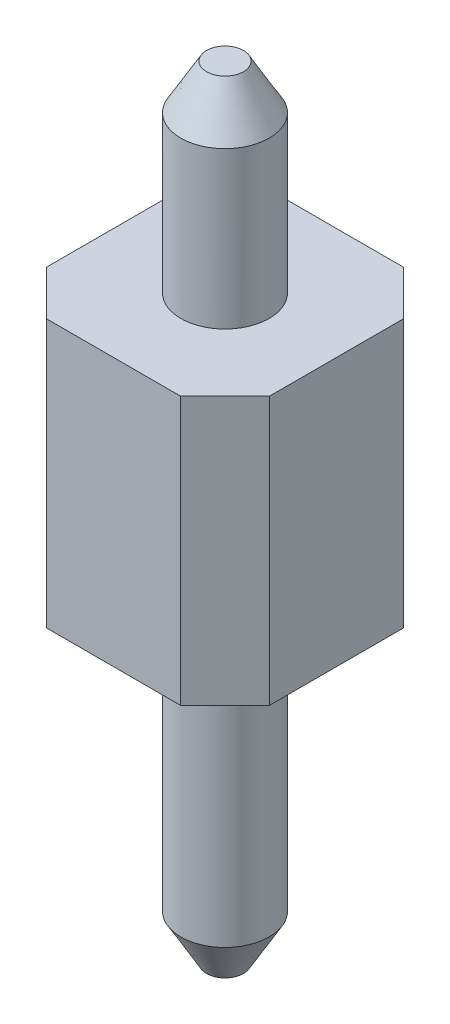
ISO-10303-21;
HEADER;
FILE_DESCRIPTION(('STEP AP214'),'2;1');
FILE_NAME('part.step','',(''),(''),'','','');
FILE_SCHEMA(('AUTOMOTIVE_DESIGN { 1 0 10303 214 1 1 1 1 }'));
ENDSEC;
DATA;
#1=APPLICATION_CONTEXT('core data for automotive mechanical design processes');
#2=APPLICATION_PROTOCOL_DEFINITION('international standard','automotive_design',2000,#1);
#3=PRODUCT_CONTEXT('',#1,'mechanical');
#4=PRODUCT('Part','Part','',(#3));
#5=PRODUCT_RELATED_PRODUCT_CATEGORY('part','',(#4));
#6=PRODUCT_DEFINITION_FORMATION('','',#4);
#7=PRODUCT_DEFINITION_CONTEXT('part definition',#1,'design');
#8=PRODUCT_DEFINITION('design','',#6,#7);
#9=PRODUCT_DEFINITION_SHAPE('','',#8);
#10=(LENGTH_UNIT() NAMED_UNIT(*) SI_UNIT(.MILLI.,.METRE.));
#11=(NAMED_UNIT(*) PLANE_ANGLE_UNIT() SI_UNIT($,.RADIAN.));
#12=(NAMED_UNIT(*) SI_UNIT($,.STERADIAN.) SOLID_ANGLE_UNIT());
#13=UNCERTAINTY_MEASURE_WITH_UNIT(LENGTH_MEASURE(1.E-05),#10,'distance_accuracy_value','');
#14=(GEOMETRIC_REPRESENTATION_CONTEXT(3) GLOBAL_UNCERTAINTY_ASSIGNED_CONTEXT((#13)) GLOBAL_UNIT_ASSIGNED_CONTEXT((#10,
#11,#12)) REPRESENTATION_CONTEXT('',''));
#15=CARTESIAN_POINT('',(0.,0.,0.));
#16=DIRECTION('',(0.,0.,1.));
#17=DIRECTION('',(1.,0.,0.));
#18=AXIS2_PLACEMENT_3D('',#15,#16,#17);
#19=CARTESIAN_POINT('',(1.25000000000001,-1.5,1.25));
#20=DIRECTION('',(0.,-1.,0.));
#21=DIRECTION('',(0.,0.,-1.));
#22=AXIS2_PLACEMENT_3D('',#19,#20,#21);
#23=PLANE('',#22);
#24=DIRECTION('',(0.,0.,1.));
#25=VECTOR('',#24,1.);
#26=CARTESIAN_POINT('',(-1.25,-1.5,-1.25));
#27=LINE('',#26,#25);
#28=CARTESIAN_POINT('',(-1.25,-1.5,-0.750000000000002));
#29=VERTEX_POINT('',#28);
#30=CARTESIAN_POINT('',(-1.25,-1.5,0.75));
#31=VERTEX_POINT('',#30);
#32=EDGE_CURVE('E121',#29,#31,#27,.T.);
#33=ORIENTED_EDGE('',*,*,#32,.F.);
#34=DIRECTION('',(-0.707106781186549,0.,0.707106781186546));
#35=VECTOR('',#34,1.);
#36=CARTESIAN_POINT('',(-0.999999999999994,-1.5,-1.00000000000001));
#37=LINE('',#36,#35);
#38=CARTESIAN_POINT('',(-0.75,-1.5,-1.25));
#39=VERTEX_POINT('',#38);
#40=EDGE_CURVE('E104',#29,#39,#37,.F.);
#41=ORIENTED_EDGE('',*,*,#40,.T.);
#42=DIRECTION('',(-1.,0.,0.));
#43=VECTOR('',#42,1.);
#44=CARTESIAN_POINT('',(-1.25,-1.5,-1.25));
#45=LINE('',#44,#43);
#46=CARTESIAN_POINT('',(0.75,-1.5,-1.25));
#47=VERTEX_POINT('',#46);
#48=EDGE_CURVE('E131',#47,#39,#45,.T.);
#49=ORIENTED_EDGE('',*,*,#48,.F.);
#50=DIRECTION('',(-0.707106781186548,0.,-0.707106781186547));
#51=VECTOR('',#50,1.);
#52=CARTESIAN_POINT('',(2.25000000000001,-1.5,0.250000000000002));
#53=LINE('',#52,#51);
#54=CARTESIAN_POINT('',(1.25,-1.5,-0.75));
#55=VERTEX_POINT('',#54);
#56=EDGE_CURVE('E115',#47,#55,#53,.F.);
#57=ORIENTED_EDGE('',*,*,#56,.T.);
#58=DIRECTION('',(0.,0.,-1.));
#59=VECTOR('',#58,1.);
#60=CARTESIAN_POINT('',(1.25,-1.5,-1.25));
#61=LINE('',#60,#59);
#62=CARTESIAN_POINT('',(1.25000000000001,-1.5,0.750000000000003));
#63=VERTEX_POINT('',#62);
#64=EDGE_CURVE('E135',#63,#55,#61,.T.);
#65=ORIENTED_EDGE('',*,*,#64,.F.);
#66=DIRECTION('',(0.707106781186549,0.,-0.707106781186546));
#67=VECTOR('',#66,1.);
#68=CARTESIAN_POINT('',(1.00000000000001,-1.5,1.));
#69=LINE('',#68,#67);
#70=CARTESIAN_POINT('',(0.750000000000007,-1.5,1.25));
#71=VERTEX_POINT('',#70);
#72=EDGE_CURVE('E150',#63,#71,#69,.F.);
#73=ORIENTED_EDGE('',*,*,#72,.T.);
#74=DIRECTION('',(1.,0.,0.));
#75=VECTOR('',#74,1.);
#76=CARTESIAN_POINT('',(-1.25,-1.5,1.25));
#77=LINE('',#76,#75);
#78=CARTESIAN_POINT('',(-0.750000000000002,-1.5,1.25));
#79=VERTEX_POINT('',#78);
#80=EDGE_CURVE('E236',#79,#71,#77,.T.);
#81=ORIENTED_EDGE('',*,*,#80,.F.);
#82=DIRECTION('',(0.707106781186546,0.,0.707106781186549));
#83=VECTOR('',#82,1.);
#84=CARTESIAN_POINT('',(0.25,-1.5,2.25000000000001));
#85=LINE('',#84,#83);
#86=EDGE_CURVE('E125',#79,#31,#85,.F.);
#87=ORIENTED_EDGE('',*,*,#86,.T.);
#88=EDGE_LOOP('',(#33,#41,#49,#57,#65,#73,#81,#87));
#89=FACE_BOUND('',#88,.T.);
#90=CARTESIAN_POINT('',(0.,-1.5,0.));
#91=DIRECTION('',(0.,-1.,0.));
#92=DIRECTION('',(0.,0.,-1.));
#93=AXIS2_PLACEMENT_3D('',#90,#91,#92);
#94=CIRCLE('',#93,0.4953);
#95=CARTESIAN_POINT('',(0.,-1.5,-0.4953));
#96=VERTEX_POINT('',#95);
#97=EDGE_CURVE('E239',#96,#96,#94,.T.);
#98=ORIENTED_EDGE('',*,*,#97,.F.);
#99=EDGE_LOOP('',(#98));
#100=FACE_BOUND('',#99,.T.);
#101=ADVANCED_FACE('F37',(#89,#100),#23,.T.);
#102=CARTESIAN_POINT('',(1.25000000000001,1.5,1.25));
#103=DIRECTION('',(0.,-1.,0.));
#104=DIRECTION('',(0.,0.,-1.));
#105=AXIS2_PLACEMENT_3D('',#102,#103,#104);
#106=PLANE('',#105);
#107=DIRECTION('',(-1.,0.,0.));
#108=VECTOR('',#107,1.);
#109=CARTESIAN_POINT('',(-1.25,1.5,-1.25));
#110=LINE('',#109,#108);
#111=CARTESIAN_POINT('',(0.75,1.5,-1.25));
#112=VERTEX_POINT('',#111);
#113=CARTESIAN_POINT('',(-0.75,1.5,-1.25));
#114=VERTEX_POINT('',#113);
#115=EDGE_CURVE('E243',#112,#114,#110,.T.);
#116=ORIENTED_EDGE('',*,*,#115,.T.);
#117=DIRECTION('',(0.707106781186549,0.,-0.707106781186546));
#118=VECTOR('',#117,1.);
#119=CARTESIAN_POINT('',(-1.25,1.5,-0.750000000000002));
#120=LINE('',#119,#118);
#121=CARTESIAN_POINT('',(-1.25,1.5,-0.750000000000002));
#122=VERTEX_POINT('',#121);
#123=EDGE_CURVE('E161',#114,#122,#120,.F.);
#124=ORIENTED_EDGE('',*,*,#123,.T.);
#125=DIRECTION('',(0.,0.,1.));
#126=VECTOR('',#125,1.);
#127=CARTESIAN_POINT('',(-1.25,1.5,-1.25));
#128=LINE('',#127,#126);
#129=CARTESIAN_POINT('',(-1.25,1.5,0.749999999999999));
#130=VERTEX_POINT('',#129);
#131=EDGE_CURVE('E124',#122,#130,#128,.T.);
#132=ORIENTED_EDGE('',*,*,#131,.T.);
#133=DIRECTION('',(-0.707106781186546,0.,-0.707106781186549));
#134=VECTOR('',#133,1.);
#135=CARTESIAN_POINT('',(-0.750000000000002,1.5,1.25));
#136=LINE('',#135,#134);
#137=CARTESIAN_POINT('',(-0.750000000000002,1.5,1.25));
#138=VERTEX_POINT('',#137);
#139=EDGE_CURVE('E156',#130,#138,#136,.F.);
#140=ORIENTED_EDGE('',*,*,#139,.T.);
#141=DIRECTION('',(1.,0.,0.));
#142=VECTOR('',#141,1.);
#143=CARTESIAN_POINT('',(-1.25,1.5,1.25));
#144=LINE('',#143,#142);
#145=CARTESIAN_POINT('',(0.750000000000007,1.5,1.25));
#146=VERTEX_POINT('',#145);
#147=EDGE_CURVE('E130',#138,#146,#144,.T.);
#148=ORIENTED_EDGE('',*,*,#147,.T.);
#149=DIRECTION('',(-0.707106781186549,0.,0.707106781186546));
#150=VECTOR('',#149,1.);
#151=CARTESIAN_POINT('',(1.25000000000001,1.5,0.750000000000003));
#152=LINE('',#151,#150);
#153=CARTESIAN_POINT('',(1.25000000000001,1.5,0.750000000000003));
#154=VERTEX_POINT('',#153);
#155=EDGE_CURVE('E59',#146,#154,#152,.F.);
#156=ORIENTED_EDGE('',*,*,#155,.T.);
#157=DIRECTION('',(0.,0.,-1.));
#158=VECTOR('',#157,1.);
#159=CARTESIAN_POINT('',(1.25,1.5,-1.25));
#160=LINE('',#159,#158);
#161=CARTESIAN_POINT('',(1.25,1.5,-0.75));
#162=VERTEX_POINT('',#161);
#163=EDGE_CURVE('E133',#154,#162,#160,.T.);
#164=ORIENTED_EDGE('',*,*,#163,.T.);
#165=DIRECTION('',(0.707106781186548,0.,0.707106781186547));
#166=VECTOR('',#165,1.);
#167=CARTESIAN_POINT('',(0.75,1.5,-1.25));
#168=LINE('',#167,#166);
#169=EDGE_CURVE('E159',#162,#112,#168,.F.);
#170=ORIENTED_EDGE('',*,*,#169,.T.);
#171=EDGE_LOOP('',(#116,#124,#132,#140,#148,#156,#164,#170));
#172=FACE_BOUND('',#171,.T.);
#173=CARTESIAN_POINT('',(0.,1.5,0.));
#174=DIRECTION('',(0.,-1.,0.));
#175=DIRECTION('',(0.,0.,-1.));
#176=AXIS2_PLACEMENT_3D('',#173,#174,#175);
#177=CIRCLE('',#176,0.4953);
#178=CARTESIAN_POINT('',(0.,1.5,-0.4953));
#179=VERTEX_POINT('',#178);
#180=EDGE_CURVE('E139',#179,#179,#177,.F.);
#181=ORIENTED_EDGE('',*,*,#180,.F.);
#182=EDGE_LOOP('',(#181));
#183=FACE_BOUND('',#182,.T.);
#184=ADVANCED_FACE('F185',(#172,#183),#106,.F.);
#185=CARTESIAN_POINT('',(-1.25,1.5,1.25));
#186=DIRECTION('',(0.,0.,-1.));
#187=DIRECTION('',(-1.,0.,0.));
#188=AXIS2_PLACEMENT_3D('',#185,#186,#187);
#189=PLANE('',#188);
#190=ORIENTED_EDGE('',*,*,#80,.T.);
#191=DIRECTION('',(0.,1.,0.));
#192=VECTOR('',#191,1.);
#193=CARTESIAN_POINT('',(0.750000000000007,1.5,1.25));
#194=LINE('',#193,#192);
#195=EDGE_CURVE('E170',#71,#146,#194,.T.);
#196=ORIENTED_EDGE('',*,*,#195,.T.);
#197=ORIENTED_EDGE('',*,*,#147,.F.);
#198=DIRECTION('',(0.,-1.,0.));
#199=VECTOR('',#198,1.);
#200=CARTESIAN_POINT('',(-0.750000000000002,1.5,1.25));
#201=LINE('',#200,#199);
#202=EDGE_CURVE('E167',#138,#79,#201,.T.);
#203=ORIENTED_EDGE('',*,*,#202,.T.);
#204=EDGE_LOOP('',(#190,#196,#197,#203));
#205=FACE_BOUND('',#204,.T.);
#206=ADVANCED_FACE('F190',(#205),#189,.F.);
#207=CARTESIAN_POINT('',(1.25,1.5,-1.25));
#208=DIRECTION('',(-1.,0.,0.));
#209=DIRECTION('',(0.,0.,1.));
#210=AXIS2_PLACEMENT_3D('',#207,#208,#209);
#211=PLANE('',#210);
#212=ORIENTED_EDGE('',*,*,#64,.T.);
#213=DIRECTION('',(0.,1.,0.));
#214=VECTOR('',#213,1.);
#215=CARTESIAN_POINT('',(1.25,1.5,-0.75));
#216=LINE('',#215,#214);
#217=EDGE_CURVE('E52',#55,#162,#216,.T.);
#218=ORIENTED_EDGE('',*,*,#217,.T.);
#219=ORIENTED_EDGE('',*,*,#163,.F.);
#220=DIRECTION('',(0.,-1.,0.));
#221=VECTOR('',#220,1.);
#222=CARTESIAN_POINT('',(1.25000000000001,1.5,0.750000000000003));
#223=LINE('',#222,#221);
#224=EDGE_CURVE('E163',#154,#63,#223,.T.);
#225=ORIENTED_EDGE('',*,*,#224,.T.);
#226=EDGE_LOOP('',(#212,#218,#219,#225));
#227=FACE_BOUND('',#226,.T.);
#228=ADVANCED_FACE('F200',(#227),#211,.F.);
#229=CARTESIAN_POINT('',(-1.25,1.5,-1.25));
#230=DIRECTION('',(0.,0.,1.));
#231=DIRECTION('',(1.,0.,0.));
#232=AXIS2_PLACEMENT_3D('',#229,#230,#231);
#233=PLANE('',#232);
#234=ORIENTED_EDGE('',*,*,#48,.T.);
#235=DIRECTION('',(0.,1.,0.));
#236=VECTOR('',#235,1.);
#237=CARTESIAN_POINT('',(-0.75,1.5,-1.25));
#238=LINE('',#237,#236);
#239=EDGE_CURVE('E109',#39,#114,#238,.T.);
#240=ORIENTED_EDGE('',*,*,#239,.T.);
#241=ORIENTED_EDGE('',*,*,#115,.F.);
#242=DIRECTION('',(0.,-1.,0.));
#243=VECTOR('',#242,1.);
#244=CARTESIAN_POINT('',(0.75,1.5,-1.25));
#245=LINE('',#244,#243);
#246=EDGE_CURVE('E114',#112,#47,#245,.T.);
#247=ORIENTED_EDGE('',*,*,#246,.T.);
#248=EDGE_LOOP('',(#234,#240,#241,#247));
#249=FACE_BOUND('',#248,.T.);
#250=ADVANCED_FACE('F197',(#249),#233,.F.);
#251=CARTESIAN_POINT('',(-1.25,1.5,-1.25));
#252=DIRECTION('',(1.,0.,0.));
#253=DIRECTION('',(0.,0.,-1.));
#254=AXIS2_PLACEMENT_3D('',#251,#252,#253);
#255=PLANE('',#254);
#256=ORIENTED_EDGE('',*,*,#131,.F.);
#257=DIRECTION('',(0.,-1.,0.));
#258=VECTOR('',#257,1.);
#259=CARTESIAN_POINT('',(-1.25,1.5,-0.750000000000002));
#260=LINE('',#259,#258);
#261=EDGE_CURVE('E108',#122,#29,#260,.T.);
#262=ORIENTED_EDGE('',*,*,#261,.T.);
#263=ORIENTED_EDGE('',*,*,#32,.T.);
#264=DIRECTION('',(0.,1.,0.));
#265=VECTOR('',#264,1.);
#266=CARTESIAN_POINT('',(-1.25,1.5,0.75));
#267=LINE('',#266,#265);
#268=EDGE_CURVE('E126',#31,#130,#267,.T.);
#269=ORIENTED_EDGE('',*,*,#268,.T.);
#270=EDGE_LOOP('',(#256,#262,#263,#269));
#271=FACE_BOUND('',#270,.T.);
#272=ADVANCED_FACE('F120',(#271),#255,.F.);
#273=CARTESIAN_POINT('',(0.,3.75,0.));
#274=DIRECTION('',(0.,-1.,0.));
#275=DIRECTION('',(0.,0.,-1.));
#276=AXIS2_PLACEMENT_3D('',#273,#274,#275);
#277=CYLINDRICAL_SURFACE('',#276,0.4953);
#278=CARTESIAN_POINT('',(0.,3.25,0.));
#279=DIRECTION('',(0.,1.,0.));
#280=DIRECTION('',(0.,0.,1.));
#281=AXIS2_PLACEMENT_3D('',#278,#279,#280);
#282=CIRCLE('',#281,0.4953);
#283=CARTESIAN_POINT('',(0.,3.25,0.4953));
#284=VERTEX_POINT('',#283);
#285=EDGE_CURVE('E145',#284,#284,#282,.F.);
#286=ORIENTED_EDGE('',*,*,#285,.T.);
#287=EDGE_LOOP('',(#286));
#288=FACE_BOUND('',#287,.T.);
#289=ORIENTED_EDGE('',*,*,#180,.T.);
#290=EDGE_LOOP('',(#289));
#291=FACE_BOUND('',#290,.T.);
#292=ADVANCED_FACE('F196',(#288,#291),#277,.T.);
#293=CARTESIAN_POINT('',(-2.89142135623731,3.75,0.));
#294=DIRECTION('',(0.,1.,0.));
#295=DIRECTION('',(0.,0.,1.));
#296=AXIS2_PLACEMENT_3D('',#293,#294,#295);
#297=PLANE('',#296);
#298=CARTESIAN_POINT('',(0.,3.75,0.));
#299=DIRECTION('',(0.,1.,0.));
#300=DIRECTION('',(0.,0.,1.));
#301=AXIS2_PLACEMENT_3D('',#298,#299,#300);
#302=CIRCLE('',#301,0.206624865405188);
#303=CARTESIAN_POINT('',(0.,3.75,0.206624865405188));
#304=VERTEX_POINT('',#303);
#305=EDGE_CURVE('E142',#304,#304,#302,.T.);
#306=ORIENTED_EDGE('',*,*,#305,.T.);
#307=EDGE_LOOP('',(#306));
#308=FACE_BOUND('',#307,.T.);
#309=ADVANCED_FACE('F210',(#308),#297,.T.);
#310=CARTESIAN_POINT('',(0.,3.75,0.));
#311=DIRECTION('',(0.,-1.,0.));
#312=DIRECTION('',(0.,0.,-1.));
#313=AXIS2_PLACEMENT_3D('',#310,#311,#312);
#314=CONICAL_SURFACE('',#313,0.206624865405188,0.523598775598297);
#315=ORIENTED_EDGE('',*,*,#285,.F.);
#316=EDGE_LOOP('',(#315));
#317=FACE_BOUND('',#316,.T.);
#318=ORIENTED_EDGE('',*,*,#305,.F.);
#319=EDGE_LOOP('',(#318));
#320=FACE_BOUND('',#319,.T.);
#321=ADVANCED_FACE('F207',(#317,#320),#314,.T.);
#322=CARTESIAN_POINT('',(-1.25,1.5,-0.750000000000002));
#323=DIRECTION('',(0.707106781186546,0.,0.707106781186549));
#324=DIRECTION('',(0.707106781186549,0.,-0.707106781186546));
#325=AXIS2_PLACEMENT_3D('',#322,#323,#324);
#326=PLANE('',#325);
#327=ORIENTED_EDGE('',*,*,#123,.F.);
#328=ORIENTED_EDGE('',*,*,#239,.F.);
#329=ORIENTED_EDGE('',*,*,#40,.F.);
#330=ORIENTED_EDGE('',*,*,#261,.F.);
#331=EDGE_LOOP('',(#327,#328,#329,#330));
#332=FACE_BOUND('',#331,.T.);
#333=ADVANCED_FACE('F107',(#332),#326,.F.);
#334=CARTESIAN_POINT('',(0.75,1.5,-1.25));
#335=DIRECTION('',(-0.707106781186547,0.,0.707106781186548));
#336=DIRECTION('',(0.707106781186548,0.,0.707106781186547));
#337=AXIS2_PLACEMENT_3D('',#334,#335,#336);
#338=PLANE('',#337);
#339=ORIENTED_EDGE('',*,*,#169,.F.);
#340=ORIENTED_EDGE('',*,*,#217,.F.);
#341=ORIENTED_EDGE('',*,*,#56,.F.);
#342=ORIENTED_EDGE('',*,*,#246,.F.);
#343=EDGE_LOOP('',(#339,#340,#341,#342));
#344=FACE_BOUND('',#343,.T.);
#345=ADVANCED_FACE('F214',(#344),#338,.F.);
#346=CARTESIAN_POINT('',(1.25000000000001,1.5,0.750000000000003));
#347=DIRECTION('',(-0.707106781186546,0.,-0.707106781186549));
#348=DIRECTION('',(-0.707106781186549,0.,0.707106781186546));
#349=AXIS2_PLACEMENT_3D('',#346,#347,#348);
#350=PLANE('',#349);
#351=ORIENTED_EDGE('',*,*,#155,.F.);
#352=ORIENTED_EDGE('',*,*,#195,.F.);
#353=ORIENTED_EDGE('',*,*,#72,.F.);
#354=ORIENTED_EDGE('',*,*,#224,.F.);
#355=EDGE_LOOP('',(#351,#352,#353,#354));
#356=FACE_BOUND('',#355,.T.);
#357=ADVANCED_FACE('F217',(#356),#350,.F.);
#358=CARTESIAN_POINT('',(-0.750000000000002,1.5,1.25));
#359=DIRECTION('',(0.707106781186549,0.,-0.707106781186546));
#360=DIRECTION('',(-0.707106781186546,0.,-0.707106781186549));
#361=AXIS2_PLACEMENT_3D('',#358,#359,#360);
#362=PLANE('',#361);
#363=ORIENTED_EDGE('',*,*,#139,.F.);
#364=ORIENTED_EDGE('',*,*,#268,.F.);
#365=ORIENTED_EDGE('',*,*,#86,.F.);
#366=ORIENTED_EDGE('',*,*,#202,.F.);
#367=EDGE_LOOP('',(#363,#364,#365,#366));
#368=FACE_BOUND('',#367,.T.);
#369=ADVANCED_FACE('F220',(#368),#362,.F.);
#370=CARTESIAN_POINT('',(0.,-5.,0.));
#371=DIRECTION('',(0.,1.,0.));
#372=DIRECTION('',(0.,0.,1.));
#373=AXIS2_PLACEMENT_3D('',#370,#371,#372);
#374=CYLINDRICAL_SURFACE('',#373,0.4953);
#375=CARTESIAN_POINT('',(0.,-4.5,0.));
#376=DIRECTION('',(0.,-1.,0.));
#377=DIRECTION('',(0.,0.,-1.));
#378=AXIS2_PLACEMENT_3D('',#375,#376,#377);
#379=CIRCLE('',#378,0.4953);
#380=CARTESIAN_POINT('',(0.,-4.5,-0.4953));
#381=VERTEX_POINT('',#380);
#382=EDGE_CURVE('E11',#381,#381,#379,.F.);
#383=ORIENTED_EDGE('',*,*,#382,.T.);
#384=EDGE_LOOP('',(#383));
#385=FACE_BOUND('',#384,.T.);
#386=ORIENTED_EDGE('',*,*,#97,.T.);
#387=EDGE_LOOP('',(#386));
#388=FACE_BOUND('',#387,.T.);
#389=ADVANCED_FACE('F181',(#385,#388),#374,.T.);
#390=CARTESIAN_POINT('',(0.,-5.,0.));
#391=DIRECTION('',(0.,-1.,0.));
#392=DIRECTION('',(0.,0.,-1.));
#393=AXIS2_PLACEMENT_3D('',#390,#391,#392);
#394=PLANE('',#393);
#395=CARTESIAN_POINT('',(0.,-5.,0.));
#396=DIRECTION('',(0.,-1.,0.));
#397=DIRECTION('',(0.,0.,-1.));
#398=AXIS2_PLACEMENT_3D('',#395,#396,#397);
#399=CIRCLE('',#398,0.206624865405187);
#400=CARTESIAN_POINT('',(0.,-5.,-0.206624865405187));
#401=VERTEX_POINT('',#400);
#402=EDGE_CURVE('E45',#401,#401,#399,.T.);
#403=ORIENTED_EDGE('',*,*,#402,.T.);
#404=EDGE_LOOP('',(#403));
#405=FACE_BOUND('',#404,.T.);
#406=ADVANCED_FACE('F174',(#405),#394,.T.);
#407=CARTESIAN_POINT('',(0.,-5.,0.));
#408=DIRECTION('',(0.,1.,0.));
#409=DIRECTION('',(0.,0.,1.));
#410=AXIS2_PLACEMENT_3D('',#407,#408,#409);
#411=CONICAL_SURFACE('',#410,0.206624865405187,0.523598775598296);
#412=ORIENTED_EDGE('',*,*,#382,.F.);
#413=EDGE_LOOP('',(#412));
#414=FACE_BOUND('',#413,.T.);
#415=ORIENTED_EDGE('',*,*,#402,.F.);
#416=EDGE_LOOP('',(#415));
#417=FACE_BOUND('',#416,.T.);
#418=ADVANCED_FACE('F39',(#414,#417),#411,.T.);
#419=CLOSED_SHELL('',(#101,#184,#206,#228,#250,#272,#292,#309,#321,#333,#345,#357,#369,#389,
#406,#418));
#420=MANIFOLD_SOLID_BREP('B2',#419);
#421=ADVANCED_BREP_SHAPE_REPRESENTATION('',(#18,#420),#14);
#422=SHAPE_DEFINITION_REPRESENTATION(#9,#421);
ENDSEC;
END-ISO-10303-21;
